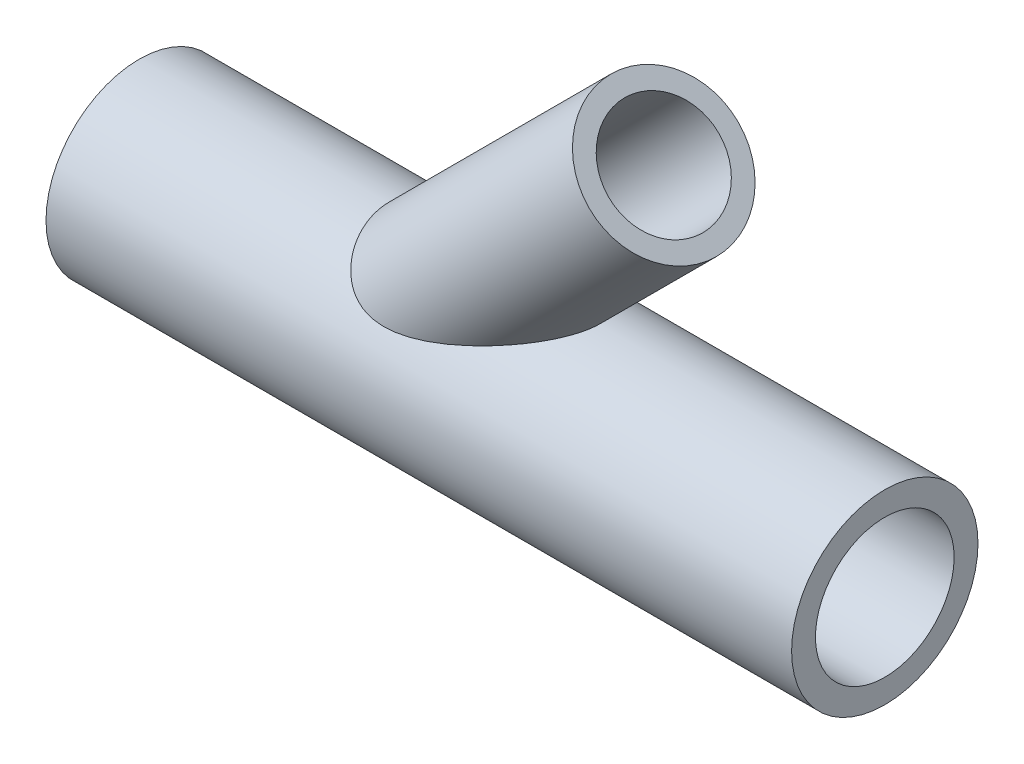
ISO-10303-21;
HEADER;
FILE_DESCRIPTION(('STEP AP214'),'2;1');
FILE_NAME('part.step','',(''),(''),'','','');
FILE_SCHEMA(('AUTOMOTIVE_DESIGN { 1 0 10303 214 1 1 1 1 }'));
ENDSEC;
DATA;
#1=APPLICATION_CONTEXT('core data for automotive mechanical design processes');
#2=APPLICATION_PROTOCOL_DEFINITION('international standard','automotive_design',2000,#1);
#3=PRODUCT_CONTEXT('',#1,'mechanical');
#4=PRODUCT('Part','Part','',(#3));
#5=PRODUCT_RELATED_PRODUCT_CATEGORY('part','',(#4));
#6=PRODUCT_DEFINITION_FORMATION('','',#4);
#7=PRODUCT_DEFINITION_CONTEXT('part definition',#1,'design');
#8=PRODUCT_DEFINITION('design','',#6,#7);
#9=PRODUCT_DEFINITION_SHAPE('','',#8);
#10=(LENGTH_UNIT() NAMED_UNIT(*) SI_UNIT(.MILLI.,.METRE.));
#11=(NAMED_UNIT(*) PLANE_ANGLE_UNIT() SI_UNIT($,.RADIAN.));
#12=(NAMED_UNIT(*) SI_UNIT($,.STERADIAN.) SOLID_ANGLE_UNIT());
#13=UNCERTAINTY_MEASURE_WITH_UNIT(LENGTH_MEASURE(1.E-05),#10,'distance_accuracy_value','');
#14=(GEOMETRIC_REPRESENTATION_CONTEXT(3) GLOBAL_UNCERTAINTY_ASSIGNED_CONTEXT((#13)) GLOBAL_UNIT_ASSIGNED_CONTEXT((#10,
#11,#12)) REPRESENTATION_CONTEXT('',''));
#15=CARTESIAN_POINT('',(0.,0.,0.));
#16=DIRECTION('',(0.,0.,1.));
#17=DIRECTION('',(1.,0.,0.));
#18=AXIS2_PLACEMENT_3D('',#15,#16,#17);
#19=CARTESIAN_POINT('',(70.3553390593273,35.3553390593274,0.));
#20=DIRECTION('',(-0.707106781186546,-0.707106781186549,0.));
#21=DIRECTION('',(0.707106781186549,-0.707106781186546,0.));
#22=AXIS2_PLACEMENT_3D('',#19,#20,#21);
#23=CYLINDRICAL_SURFACE('',#22,7.4);
#24=CARTESIAN_POINT('',(58.1651803615609,12.7,0.));
#25=CARTESIAN_POINT('',(58.1651789008527,12.699999548078,0.108244173223875));
#26=CARTESIAN_POINT('',(58.1604220787971,12.6986111948497,0.216495087531113));
#27=CARTESIAN_POINT('',(58.1415458061834,12.6931058585771,0.432122754992492));
#28=CARTESIAN_POINT('',(58.1274225068207,12.6889877538437,0.539499130419205));
#29=CARTESIAN_POINT('',(58.0714566474928,12.6726859282086,0.859342238657946));
#30=CARTESIAN_POINT('',(58.0160190450949,12.6565549918511,1.06933975447832));
#31=CARTESIAN_POINT('',(57.8567056953034,12.6103974116833,1.52753200641348));
#32=CARTESIAN_POINT('',(57.7442732832222,12.5779298023519,1.77242813326582));
#33=CARTESIAN_POINT('',(57.4831047096593,12.5030945500601,2.24032882942173));
#34=CARTESIAN_POINT('',(57.334300182515,12.4607082702662,2.46329105145652));
#35=CARTESIAN_POINT('',(57.0419304825086,12.378228131888,2.84604294677887));
#36=CARTESIAN_POINT('',(56.9029683798986,12.3392899427971,3.00968817793791));
#37=CARTESIAN_POINT('',(56.6116621701875,12.2583848845806,3.32390425584419));
#38=CARTESIAN_POINT('',(56.4593093972266,12.2164160573386,3.4744665086613));
#39=CARTESIAN_POINT('',(56.1439141003845,12.1304112645088,3.76376527884728));
#40=CARTESIAN_POINT('',(55.9808541138317,12.086371957093,3.90248158411888));
#41=CARTESIAN_POINT('',(55.6463062073331,11.9970525069504,4.16899077811774));
#42=CARTESIAN_POINT('',(55.4748151233686,11.9517719012539,4.29677951590353));
#43=CARTESIAN_POINT('',(55.1346061499625,11.8631046873902,4.53564402298606));
#44=CARTESIAN_POINT('',(54.9662512789594,11.8197502666544,4.64725190740537));
#45=CARTESIAN_POINT('',(54.6244056015769,11.7329236524064,4.86229862166291));
#46=CARTESIAN_POINT('',(54.4509138809425,11.6894514391956,4.96573598515197));
#47=CARTESIAN_POINT('',(54.0994643652391,11.6027391959096,5.16510087182581));
#48=CARTESIAN_POINT('',(53.9215037045194,11.5594993375755,5.26102340498121));
#49=CARTESIAN_POINT('',(53.5617985639735,11.4736085477517,5.44579410262459));
#50=CARTESIAN_POINT('',(53.380053641722,11.4309576861033,5.5346414340124));
#51=CARTESIAN_POINT('',(52.8288258714324,11.3041132779681,5.79169240960914));
#52=CARTESIAN_POINT('',(52.4543137969051,11.2212677939657,5.94986615567069));
#53=CARTESIAN_POINT('',(51.694872630965,11.0615745158114,6.24172679535999));
#54=CARTESIAN_POINT('',(51.309947090847,10.984724710834,6.37542191904198));
#55=CARTESIAN_POINT('',(50.4918836082852,10.8320228886013,6.63187334281567));
#56=CARTESIAN_POINT('',(50.0578039283282,10.7570562019773,6.75215959863586));
#57=CARTESIAN_POINT('',(49.1803862815186,10.6207938660031,6.9645282839267));
#58=CARTESIAN_POINT('',(48.737044404034,10.5595041242579,7.05659853219065));
#59=CARTESIAN_POINT('',(48.0674232859544,10.4812048927015,7.17192204174472));
#60=CARTESIAN_POINT('',(47.8438445671723,10.457407592918,7.20652536022737));
#61=CARTESIAN_POINT('',(47.3951314388341,10.4149145792035,7.2678025047416));
#62=CARTESIAN_POINT('',(47.1699972397554,10.3962181883952,7.29447738289838));
#63=CARTESIAN_POINT('',(46.7186270640839,10.3646003063861,7.33933331105119));
#64=CARTESIAN_POINT('',(46.4923919516263,10.351674852752,7.35752018945632));
#65=CARTESIAN_POINT('',(46.0391209733977,10.3322972869691,7.38470815376724));
#66=CARTESIAN_POINT('',(45.8120852677782,10.32584394651,7.39371098267381));
#67=CARTESIAN_POINT('',(45.34652199899,10.3200126872511,7.40184932305668));
#68=CARTESIAN_POINT('',(45.1079795798791,10.3209991898263,7.40047660842852));
#69=CARTESIAN_POINT('',(44.6314759862479,10.331774844477,7.38542629566381));
#70=CARTESIAN_POINT('',(44.3935147506239,10.3415630273626,7.37175005232039));
#71=CARTESIAN_POINT('',(43.9194209482662,10.3707139930897,7.33068446107193));
#72=CARTESIAN_POINT('',(43.6832876994213,10.3900730104502,7.30330050617823));
#73=CARTESIAN_POINT('',(43.2143057422556,10.4389465450687,7.2332721420223));
#74=CARTESIAN_POINT('',(42.9814570990882,10.468461263481,7.19062743048914));
#75=CARTESIAN_POINT('',(42.5178608388211,10.5383531834249,7.08780902864768));
#76=CARTESIAN_POINT('',(42.2871852196108,10.5788730800303,7.02740414129191));
#77=CARTESIAN_POINT('',(41.8336493493059,10.6702787499379,6.88782300464843));
#78=CARTESIAN_POINT('',(41.6107889237084,10.721164291616,6.80864717479771));
#79=CARTESIAN_POINT('',(41.1757936380917,10.8322209264459,6.63053381535525));
#80=CARTESIAN_POINT('',(40.9636467859811,10.8923813177128,6.53161902353354));
#81=CARTESIAN_POINT('',(40.5524824592066,11.0202564758945,6.31346972782465));
#82=CARTESIAN_POINT('',(40.3534626533053,11.0879698956848,6.19423884543008));
#83=CARTESIAN_POINT('',(39.9984241307966,11.2184032345781,5.95426604928342));
#84=CARTESIAN_POINT('',(39.8403361145002,11.2804421941622,5.83620400544654));
#85=CARTESIAN_POINT('',(39.5367075638536,11.4064798256842,5.58586101231295));
#86=CARTESIAN_POINT('',(39.3911659263064,11.4704783246486,5.45358131547029));
#87=CARTESIAN_POINT('',(39.1134852405948,11.5985649853126,5.17558801991359));
#88=CARTESIAN_POINT('',(38.9813505982292,11.6626531695153,5.0298700349533));
#89=CARTESIAN_POINT('',(38.7311401775431,11.7890186126778,4.72610713925576));
#90=CARTESIAN_POINT('',(38.6130641870496,11.8512958989569,4.56806241461316));
#91=CARTESIAN_POINT('',(38.3997374681528,11.9676823030759,4.25330091022975));
#92=CARTESIAN_POINT('',(38.3034350866742,12.0220527657829,4.09739117449186));
#93=CARTESIAN_POINT('',(38.1232754854543,12.1264752966166,3.77716229988067));
#94=CARTESIAN_POINT('',(38.0394183089028,12.1765273497565,3.61284313182594));
#95=CARTESIAN_POINT('',(37.8842082004383,12.2711928687847,3.27693016850308));
#96=CARTESIAN_POINT('',(37.8128535386878,12.3158070867869,3.105337383693));
#97=CARTESIAN_POINT('',(37.6826183038843,12.3986601891641,2.75598561254152));
#98=CARTESIAN_POINT('',(37.6237382951993,12.4368987850819,2.57822634764451));
#99=CARTESIAN_POINT('',(37.516204899705,12.5076726805187,2.21013591863197));
#100=CARTESIAN_POINT('',(37.4680838106593,12.539901626048,2.01959013424612));
#101=CARTESIAN_POINT('',(37.3852862429696,12.5958997285987,1.63437897617122));
#102=CARTESIAN_POINT('',(37.3506100492606,12.619668706329,1.43971351526692));
#103=CARTESIAN_POINT('',(37.2946474078205,12.6582560484483,1.04755810089604));
#104=CARTESIAN_POINT('',(37.2733631678357,12.6730729370141,0.850067687204109));
#105=CARTESIAN_POINT('',(37.2441586141583,12.6934479476326,0.45362637538676));
#106=CARTESIAN_POINT('',(37.2362384499825,12.6990059660974,0.254675460946324));
#107=CARTESIAN_POINT('',(37.2337170444398,12.700772452614,-0.148458214523873));
#108=CARTESIAN_POINT('',(37.2394624775178,12.6967375650261,-0.35264433855129));
#109=CARTESIAN_POINT('',(37.2650084805667,12.6788938399085,-0.759709382606115));
#110=CARTESIAN_POINT('',(37.2848093339524,12.6650848052917,-0.962588276191149));
#111=CARTESIAN_POINT('',(37.3385037992077,12.6279863459932,-1.36561956175567));
#112=CARTESIAN_POINT('',(37.3723989094782,12.6046959133222,-1.56577166150458));
#113=CARTESIAN_POINT('',(37.4543351148149,12.5491424832461,-1.96189242671704));
#114=CARTESIAN_POINT('',(37.5023761394314,12.5168795305262,-2.15786111300969));
#115=CARTESIAN_POINT('',(37.6127380860078,12.4440563017343,-2.54444496400459));
#116=CARTESIAN_POINT('',(37.6750776210915,12.4034852179752,-2.73505278389204));
#117=CARTESIAN_POINT('',(37.8140542677354,12.3150166599446,-3.10923202361647));
#118=CARTESIAN_POINT('',(37.890691463156,12.2671191427017,-3.29280340217487));
#119=CARTESIAN_POINT('',(38.058264779384,12.1651714743429,-3.65148743361262));
#120=CARTESIAN_POINT('',(38.1491987054172,12.1111222679596,-3.82660137945663));
#121=CARTESIAN_POINT('',(38.3453098606082,11.9982460940792,-4.16704342023861));
#122=CARTESIAN_POINT('',(38.4504866871698,11.9394192616473,-4.33237179159013));
#123=CARTESIAN_POINT('',(38.6722322957213,11.8199963666108,-4.64817301467837));
#124=CARTESIAN_POINT('',(38.7884724113481,11.7594751659759,-4.79890490748687));
#125=CARTESIAN_POINT('',(39.0339904315142,11.6369961474927,-5.08872019053185));
#126=CARTESIAN_POINT('',(39.1632680138832,11.575038365173,-5.22780386845328));
#127=CARTESIAN_POINT('',(39.4342031342707,11.4514216188833,-5.49330337844388));
#128=CARTESIAN_POINT('',(39.5758532908586,11.3897624995977,-5.61972666830649));
#129=CARTESIAN_POINT('',(39.8707599542376,11.2684058869802,-5.85927177983793));
#130=CARTESIAN_POINT('',(40.0240160949668,11.2087083318642,-5.97239402074515));
#131=CARTESIAN_POINT('',(40.334219497193,11.0953587335491,-6.18032659901079));
#132=CARTESIAN_POINT('',(40.4907256369596,11.0415571665897,-6.2757146925634));
#133=CARTESIAN_POINT('',(40.8121917653758,10.9384322094817,-6.4537812532788));
#134=CARTESIAN_POINT('',(40.9771512727383,10.8891085648278,-6.53646044294515));
#135=CARTESIAN_POINT('',(41.3142695358484,10.7959043857184,-6.68928011616111));
#136=CARTESIAN_POINT('',(41.4864291206593,10.7520244804103,-6.75941915082435));
#137=CARTESIAN_POINT('',(41.8366293064744,10.6703883328511,-6.8875669367877));
#138=CARTESIAN_POINT('',(42.0146712060171,10.6326334537372,-6.9455729886962));
#139=CARTESIAN_POINT('',(42.4345013025009,10.5523422986666,-7.0671801335223));
#140=CARTESIAN_POINT('',(42.6780487218826,10.5122977004548,-7.12637887311764));
#141=CARTESIAN_POINT('',(43.1705293269107,10.4439452972948,-7.22617767363826));
#142=CARTESIAN_POINT('',(43.4194642007605,10.415641229052,-7.26677181363382));
#143=CARTESIAN_POINT('',(43.9208983718915,10.3703171327896,-7.33130802499567));
#144=CARTESIAN_POINT('',(44.1734031511367,10.3533169663651,-7.35522078984305));
#145=CARTESIAN_POINT('',(44.6798950804663,10.3298705887473,-7.38810829599605));
#146=CARTESIAN_POINT('',(44.9338827285125,10.3234281550869,-7.39707769061667));
#147=CARTESIAN_POINT('',(45.5927279914035,10.3191305114363,-7.40308685161268));
#148=CARTESIAN_POINT('',(45.9977409690671,10.3286325714142,-7.38989886640816));
#149=CARTESIAN_POINT('',(46.8048820659145,10.3677010959368,-7.33497032035285));
#150=CARTESIAN_POINT('',(47.2070080576478,10.3972810741275,-7.29321052880724));
#151=CARTESIAN_POINT('',(48.0075096231026,10.4727301312731,-7.1844492367159));
#152=CARTESIAN_POINT('',(48.4058694304787,10.518650131083,-7.11736878853682));
#153=CARTESIAN_POINT('',(49.1961078229414,10.6233804191029,-6.96007928686144));
#154=CARTESIAN_POINT('',(49.5879880305333,10.6821874261542,-6.86987611964613));
#155=CARTESIAN_POINT('',(50.3946715176457,10.8148495181472,-6.65925886562449));
#156=CARTESIAN_POINT('',(50.8088657847118,10.8895225278042,-6.5370317398182));
#157=CARTESIAN_POINT('',(51.6271357204955,11.0475243226196,-6.26632624213842));
#158=CARTESIAN_POINT('',(52.0312075727184,11.1308563133168,-6.11783813411451));
#159=CARTESIAN_POINT('',(52.6269212365533,11.2600375636826,-5.87451273073009));
#160=CARTESIAN_POINT('',(52.8233698536201,11.3037018804226,-5.79016496731934));
#161=CARTESIAN_POINT('',(53.2127105715463,11.3921356336562,-5.6141745371604));
#162=CARTESIAN_POINT('',(53.4056030420154,11.4369049541567,-5.52253263385651));
#163=CARTESIAN_POINT('',(53.7872156460823,11.52716726742,-5.33156276867032));
#164=CARTESIAN_POINT('',(53.9759383946643,11.5726597739774,-5.23223981052693));
#165=CARTESIAN_POINT('',(54.3486648464014,11.6640107467336,-5.02530098212192));
#166=CARTESIAN_POINT('',(54.5326693991286,11.7098691450711,-4.91768661901036));
#167=CARTESIAN_POINT('',(54.8627696767981,11.7933466859682,-4.71347716549682));
#168=CARTESIAN_POINT('',(55.009767874715,11.8309749584089,-4.61834540420393));
#169=CARTESIAN_POINT('',(55.2994089389144,11.9059212597034,-4.42155271093671));
#170=CARTESIAN_POINT('',(55.4420521070534,11.9432393099284,-4.31989223300485));
#171=CARTESIAN_POINT('',(55.7224572952238,12.0173130436614,-4.10933851383398));
#172=CARTESIAN_POINT('',(55.8602108511002,12.0540676948586,-4.00043358706829));
#173=CARTESIAN_POINT('',(56.129594381824,12.1265697713528,-3.77496169096172));
#174=CARTESIAN_POINT('',(56.2612243485779,12.1623171953185,-3.6583947114943));
#175=CARTESIAN_POINT('',(56.5185568022069,12.2327432988591,-3.41557343080383));
#176=CARTESIAN_POINT('',(56.644175847798,12.2674054101849,-3.28922482258599));
#177=CARTESIAN_POINT('',(56.8861198106336,12.3346207780499,-3.0274441929099));
#178=CARTESIAN_POINT('',(57.0024426818437,12.3671735700434,-2.89201018380632));
#179=CARTESIAN_POINT('',(57.3337688920633,12.4604429358956,-2.47174080880281));
#180=CARTESIAN_POINT('',(57.5322118964101,12.5170688556738,-2.17195896347259));
#181=CARTESIAN_POINT('',(57.7965863831512,12.5930329022021,-1.6566860461604));
#182=CARTESIAN_POINT('',(57.8841110705632,12.618330491836,-1.45324667696206));
#183=CARTESIAN_POINT('',(57.9907266503023,12.6492314096893,-1.13930703813134));
#184=CARTESIAN_POINT('',(58.0221372300984,12.6583527641369,-1.03328967974186));
#185=CARTESIAN_POINT('',(58.0760614561397,12.6740291453028,-0.81885146370351));
#186=CARTESIAN_POINT('',(58.098579176272,12.6805853471244,-0.710431730697702));
#187=CARTESIAN_POINT('',(58.1324956621778,12.6904666011703,-0.501930606381205));
#188=CARTESIAN_POINT('',(58.144724085967,12.694032644962,-0.401995286887124));
#189=CARTESIAN_POINT('',(58.1610682441213,12.6987998836951,-0.201375389778799));
#190=CARTESIAN_POINT('',(58.165181720337,12.7000004203857,-0.100690611433872));
#191=CARTESIAN_POINT('',(58.1651803615609,12.7,0.));
#192=B_SPLINE_CURVE_WITH_KNOTS('',3,(#24,#25,#26,#27,#28,#29,#30,#31,#32,#33,#34,#35,#36,#37,
#38,#39,#40,#41,#42,#43,#44,#45,#46,#47,#48,#49,#50,#51,#52,#53,#54,#55,#56,#57,#58,#59,#60,#61,
#62,#63,#64,#65,#66,#67,#68,#69,#70,#71,#72,#73,#74,#75,#76,#77,#78,#79,#80,#81,#82,#83,#84,#85,
#86,#87,#88,#89,#90,#91,#92,#93,#94,#95,#96,#97,#98,#99,#100,#101,#102,#103,#104,#105,#106,#107,
#108,#109,#110,#111,#112,#113,#114,#115,#116,#117,#118,#119,#120,#121,#122,#123,#124,#125,#126,
#127,#128,#129,#130,#131,#132,#133,#134,#135,#136,#137,#138,#139,#140,#141,#142,#143,#144,#145,
#146,#147,#148,#149,#150,#151,#152,#153,#154,#155,#156,#157,#158,#159,#160,#161,#162,#163,#164,
#165,#166,#167,#168,#169,#170,#171,#172,#173,#174,#175,#176,#177,#178,#179,#180,#181,#182,#183,
#184,#185,#186,#187,#188,#189,#190,#191),.UNSPECIFIED.,.T.,.F.,(4,2,2,2,2,2,2,2,2,2,2,2,2,2,2,2,
2,2,2,2,2,2,2,2,2,2,2,2,2,2,2,2,2,2,2,2,2,2,2,2,2,2,2,2,2,2,2,2,2,2,2,2,2,2,2,2,2,2,2,2,2,2,2,2,
2,2,2,2,2,2,2,2,2,2,2,2,2,2,2,2,2,2,2,4),(0.,0.324623680192715,0.649380835096575,
1.29943679064074,2.10927581738179,2.92064889780288,3.57432073514649,4.22841875989913,
4.8836114210922,5.53905186807047,6.15857438663645,6.7782078384016,7.3982493144834,
8.01836369240016,9.2619739235965,10.5051652648016,11.873964764969,13.2433543634158,
13.9256585942986,14.6078722411216,15.2896167442325,15.9712318379377,16.6864433351718,
17.4015760871076,18.1164277059463,18.8312934846883,19.5559115968102,20.2805135188555,
21.00428552382,21.7279286458151,22.3475710252521,22.9671588641454,23.5869496566412,
24.2067310940729,24.7795431191258,25.3523571320189,25.9250918281563,26.4978524299542,
27.0946280187982,27.6914162542942,28.2883028482565,28.8851961201202,29.4973924513322,
30.1096011272874,30.7218749055574,31.3341456346218,31.9472179582421,32.5602938778397,
33.1732757723232,33.7862403436087,34.3846926186761,34.983130108945,35.5812129809202,
36.1792769967471,36.7516585592434,37.3240075696963,37.8964226665365,38.4689649812954,
39.2292483113778,39.9897734345466,40.7516313369487,41.5137617709177,42.7278154033749,
43.9426869782376,45.1613781329088,46.3797593566008,47.6935814750133,49.0078917125613,
49.6623818158574,50.3168035065166,50.9708024154885,51.6246827245904,52.1618111938561,
52.6989023486549,53.2368819028741,53.7748621681269,54.3189006243683,54.8630584924499,
55.9469476721284,56.6130334421023,56.9455188885536,57.2778518437013,57.5797384393799,
57.8817090293063),.UNSPECIFIED.);
#193=CARTESIAN_POINT('',(58.1651803615609,12.7,0.));
#194=VERTEX_POINT('',#193);
#195=EDGE_CURVE('E68',#194,#194,#192,.T.);
#196=ORIENTED_EDGE('',*,*,#195,.T.);
#197=EDGE_LOOP('',(#196));
#198=FACE_BOUND('',#197,.T.);
#199=CARTESIAN_POINT('',(70.3553390593273,35.3553390593274,0.));
#200=DIRECTION('',(0.707106781186546,0.707106781186549,0.));
#201=DIRECTION('',(-0.707106781186549,0.707106781186546,0.));
#202=AXIS2_PLACEMENT_3D('',#199,#200,#201);
#203=CIRCLE('',#202,7.4);
#204=CARTESIAN_POINT('',(65.1227488785468,40.5879292401079,0.));
#205=VERTEX_POINT('',#204);
#206=EDGE_CURVE('E58',#205,#205,#203,.T.);
#207=ORIENTED_EDGE('',*,*,#206,.T.);
#208=EDGE_LOOP('',(#207));
#209=FACE_BOUND('',#208,.T.);
#210=ADVANCED_FACE('F54',(#198,#209),#23,.F.);
#211=CARTESIAN_POINT('',(70.3553390593273,35.3553390593274,0.));
#212=DIRECTION('',(-0.707106781186546,-0.707106781186549,0.));
#213=DIRECTION('',(0.707106781186549,-0.707106781186546,0.));
#214=AXIS2_PLACEMENT_3D('',#211,#212,#213);
#215=CYLINDRICAL_SURFACE('',#214,10.);
#216=CARTESIAN_POINT('',(61.8421356237309,12.7,0.));
#217=CARTESIAN_POINT('',(61.8421371479667,12.7000005610799,0.131961662253304));
#218=CARTESIAN_POINT('',(61.8363710411209,12.6979381196656,0.263913481839501));
#219=CARTESIAN_POINT('',(61.8134807517401,12.6897530325315,0.526743182841068));
#220=CARTESIAN_POINT('',(61.7963527153073,12.6836290091477,0.657620684599788));
#221=CARTESIAN_POINT('',(61.7512136321504,12.6674974303103,0.917304174292113));
#222=CARTESIAN_POINT('',(61.7231964336132,12.6574876796256,1.04610894832894));
#223=CARTESIAN_POINT('',(61.6570076848368,12.6338556854685,1.30079343642201));
#224=CARTESIAN_POINT('',(61.6188306265074,12.620231482461,1.42667152342429));
#225=CARTESIAN_POINT('',(61.5225753549305,12.585909027954,1.70565062901165));
#226=CARTESIAN_POINT('',(61.461909321649,12.5642942325214,1.85774699790616));
#227=CARTESIAN_POINT('',(61.3279616564593,12.5166313422031,2.15562718860018));
#228=CARTESIAN_POINT('',(61.254670541312,12.4905799149417,2.30140616136184));
#229=CARTESIAN_POINT('',(61.0971923705312,12.4346889826039,2.586432874738));
#230=CARTESIAN_POINT('',(61.0129900393165,12.4048441679699,2.72567107880722));
#231=CARTESIAN_POINT('',(60.835427701731,12.3420176093802,2.99733793527496));
#232=CARTESIAN_POINT('',(60.7420697253734,12.3090365608474,3.12976808729163));
#233=CARTESIAN_POINT('',(60.484182719671,12.2181082846124,3.47226097622895));
#234=CARTESIAN_POINT('',(60.3129236885232,12.1578987299515,3.67666862119077));
#235=CARTESIAN_POINT('',(59.9542172714685,12.0322696932411,4.06902384139381));
#236=CARTESIAN_POINT('',(59.7667585082468,11.9668465521636,4.25695965854679));
#237=CARTESIAN_POINT('',(59.3790312542159,11.832118827383,4.61824439078994));
#238=CARTESIAN_POINT('',(59.178741393757,11.7628077937601,4.79156779625888));
#239=CARTESIAN_POINT('',(58.7682333801956,11.6214502826476,5.1249070931776));
#240=CARTESIAN_POINT('',(58.5580113502504,11.5494027391987,5.28491771980669));
#241=CARTESIAN_POINT('',(58.1233118819401,11.4012485027346,5.59752835826585));
#242=CARTESIAN_POINT('',(57.8985966871114,11.3250847823115,5.74976896531456));
#243=CARTESIAN_POINT('',(57.4423648902265,11.1714476500718,6.04285705798288));
#244=CARTESIAN_POINT('',(57.2108490756626,11.0939743903338,6.18370585570704));
#245=CARTESIAN_POINT('',(56.7419070646712,10.9381885391159,6.45527340144686));
#246=CARTESIAN_POINT('',(56.5044750820971,10.8598751723181,6.58598167328739));
#247=CARTESIAN_POINT('',(56.0247956336967,10.7029576445064,6.83803564325694));
#248=CARTESIAN_POINT('',(55.7825480621648,10.6243534771402,6.95938113558024));
#249=CARTESIAN_POINT('',(55.2931580738645,10.4670319143488,7.1938327195503));
#250=CARTESIAN_POINT('',(55.046002960765,10.388314907001,7.30691249814996));
#251=CARTESIAN_POINT('',(54.5480101390296,10.2313892567559,7.52507321517223));
#252=CARTESIAN_POINT('',(54.2971721276833,10.1531806564173,7.63015349164718));
#253=CARTESIAN_POINT('',(53.7923624255943,9.99769417282468,7.83277778483909));
#254=CARTESIAN_POINT('',(53.5383925144358,9.92041580624868,7.93032587155819));
#255=CARTESIAN_POINT('',(53.0274796373724,9.76712093818132,8.11837803056292));
#256=CARTESIAN_POINT('',(52.7705366061499,9.69110446450263,8.20888194775374));
#257=CARTESIAN_POINT('',(52.2123369019431,9.52862618041328,8.39721022123671));
#258=CARTESIAN_POINT('',(51.9106028698118,9.44245196770706,8.493868967614));
#259=CARTESIAN_POINT('',(51.3036919844342,9.27300154383056,8.67854495295752));
#260=CARTESIAN_POINT('',(50.9985150564926,9.18972539569583,8.76656200403469));
#261=CARTESIAN_POINT('',(50.3847095212583,9.02678359205008,8.93425154508552));
#262=CARTESIAN_POINT('',(50.0760789435634,8.94712014395162,9.01391897127239));
#263=CARTESIAN_POINT('',(49.4556620063932,8.79235051607829,9.16494734940578));
#264=CARTESIAN_POINT('',(49.1438757138277,8.71724423991395,9.23630847706951));
#265=CARTESIAN_POINT('',(48.5183474036244,8.57292051095795,9.37041619533412));
#266=CARTESIAN_POINT('',(48.2046166854046,8.50368255541787,9.43319329214827));
#267=CARTESIAN_POINT('',(47.5740923189728,8.3720768564062,9.55018744678488));
#268=CARTESIAN_POINT('',(47.2572984351277,8.30970964611257,9.60440384042787));
#269=CARTESIAN_POINT('',(46.6210286676381,8.19350619374254,9.7037257154964));
#270=CARTESIAN_POINT('',(46.3015555930413,8.13966196700759,9.74883973539137));
#271=CARTESIAN_POINT('',(45.6598263304905,8.04242989012919,9.82920672405434));
#272=CARTESIAN_POINT('',(45.3375708156593,7.99903958056086,9.86446201253597));
#273=CARTESIAN_POINT('',(44.7473712398146,7.93167225612642,9.91867447090217));
#274=CARTESIAN_POINT('',(44.4798297921823,7.90562402128103,9.9394066697135));
#275=CARTESIAN_POINT('',(43.9433692494618,7.86399088833764,9.97237993120289));
#276=CARTESIAN_POINT('',(43.6744501258429,7.84840620782109,9.98462081731091));
#277=CARTESIAN_POINT('',(43.1360125136861,7.82964155673413,9.99934321093796));
#278=CARTESIAN_POINT('',(42.8664944198919,7.82645499447297,10.0018299044611));
#279=CARTESIAN_POINT('',(42.3277744270969,7.83460975933379,9.99544617994009));
#280=CARTESIAN_POINT('',(42.0585724871158,7.84594893103973,9.98657744688269));
#281=CARTESIAN_POINT('',(41.5631795574895,7.88229609594536,9.95790368975085));
#282=CARTESIAN_POINT('',(41.3367113978302,7.90494655596093,9.93998013552232));
#283=CARTESIAN_POINT('',(40.8865735820033,7.96335779960396,9.89324746059373));
#284=CARTESIAN_POINT('',(40.6629036829345,7.99911743701684,9.86443929159454));
#285=CARTESIAN_POINT('',(40.2204786616722,8.0844433566493,9.79463169869313));
#286=CARTESIAN_POINT('',(40.0017162734446,8.13398753959401,9.75365178139837));
#287=CARTESIAN_POINT('',(39.570799881084,8.24703423638344,9.65825501872382));
#288=CARTESIAN_POINT('',(39.3586455764204,8.31053611438183,9.60383878542488));
#289=CARTESIAN_POINT('',(38.9415589106189,8.4513180868596,9.48019233907989));
#290=CARTESIAN_POINT('',(38.736689480516,8.52869401113909,9.41085837512174));
#291=CARTESIAN_POINT('',(38.337727136143,8.6953407849413,9.25709880867004));
#292=CARTESIAN_POINT('',(38.1436346202364,8.78461207375636,9.17267264878675));
#293=CARTESIAN_POINT('',(37.767478858459,8.97287231357693,8.98859790724729));
#294=CARTESIAN_POINT('',(37.5854290777521,9.07187184455169,8.88893268535838));
#295=CARTESIAN_POINT('',(37.2344362631513,9.27682349130739,8.67481917704987));
#296=CARTESIAN_POINT('',(37.0654933177454,9.38277565401861,8.5603707908388));
#297=CARTESIAN_POINT('',(36.7565737711554,9.58848840135513,8.32901586840473));
#298=CARTESIAN_POINT('',(36.6153729364219,9.68786873694251,8.21339693686312));
#299=CARTESIAN_POINT('',(36.3438449917091,9.88808454558737,7.97122703409634));
#300=CARTESIAN_POINT('',(36.2135168436319,9.98891987864443,7.8446771088897));
#301=CARTESIAN_POINT('',(35.9634639539604,10.1902727616607,7.58128102619809));
#302=CARTESIAN_POINT('',(35.8437395748214,10.290790300644,7.4444345170534));
#303=CARTESIAN_POINT('',(35.6145422379247,10.4899290262879,7.16110225015043));
#304=CARTESIAN_POINT('',(35.5050705915152,10.5885499690912,7.01461526342145));
#305=CARTESIAN_POINT('',(35.27744716401,10.7997232713608,6.68585101636826));
#306=CARTESIAN_POINT('',(35.1612068584262,10.9116390751966,6.50183793559778));
#307=CARTESIAN_POINT('',(34.9418698886712,11.1289345008368,6.12246863715461));
#308=CARTESIAN_POINT('',(34.8387743177445,11.2343135786094,5.92711147796171));
#309=CARTESIAN_POINT('',(34.6451843976133,11.4369211654628,5.52605905223785));
#310=CARTESIAN_POINT('',(34.5546959924708,11.5341458213337,5.32035897097935));
#311=CARTESIAN_POINT('',(34.3859680970813,11.7189816791754,4.89982015886693));
#312=CARTESIAN_POINT('',(34.3077290680428,11.8065925191338,4.68498108430259));
#313=CARTESIAN_POINT('',(34.1539728462681,11.9814819765097,4.21942188397106));
#314=CARTESIAN_POINT('',(34.0800701701506,12.0672984022484,3.96761574683367));
#315=CARTESIAN_POINT('',(33.9470863175516,12.2237937655783,3.45551306094629));
#316=CARTESIAN_POINT('',(33.8880063523763,12.2944714659698,3.19521582026946));
#317=CARTESIAN_POINT('',(33.7844338457452,12.4195813456174,2.66785450447587));
#318=CARTESIAN_POINT('',(33.7399435158767,12.4740110617915,2.40078941004977));
#319=CARTESIAN_POINT('',(33.6654142621561,12.5657717594221,1.86175399341119));
#320=CARTESIAN_POINT('',(33.6353751754038,12.6031029336201,1.58978372652764));
#321=CARTESIAN_POINT('',(33.5892344692677,12.6606306875451,1.03772257456195));
#322=CARTESIAN_POINT('',(33.5734017205359,12.6804965820444,0.757574636889979));
#323=CARTESIAN_POINT('',(33.5565919567633,12.7015925537757,0.196129248700871));
#324=CARTESIAN_POINT('',(33.5556152273634,12.7028222726846,-0.0851682238146874));
#325=CARTESIAN_POINT('',(33.5685149689417,12.6866268611763,-0.646865026477152));
#326=CARTESIAN_POINT('',(33.5823904353361,12.6692029924645,-0.927264416082672));
#327=CARTESIAN_POINT('',(33.6250312235671,12.6159738553046,-1.48516833470235));
#328=CARTESIAN_POINT('',(33.6537964284071,12.5801687312879,-1.76267288644533));
#329=CARTESIAN_POINT('',(33.7261044248567,12.4909847119356,-2.31130150596567));
#330=CARTESIAN_POINT('',(33.7695653997462,12.4377031624379,-2.58245219896369));
#331=CARTESIAN_POINT('',(33.8714478632404,12.3143547540901,-3.11804154253351));
#332=CARTESIAN_POINT('',(33.9298693882556,12.2442878543886,-3.38248017676806));
#333=CARTESIAN_POINT('',(34.0619301614943,12.0884671962578,-3.90291834790488));
#334=CARTESIAN_POINT('',(34.135575457273,12.0027072053974,-4.15891448406965));
#335=CARTESIAN_POINT('',(34.2984094949496,11.8169548751679,-4.66059221232636));
#336=CARTESIAN_POINT('',(34.3875981817455,11.7169625862531,-4.90627384097984));
#337=CARTESIAN_POINT('',(34.5826925532396,11.50374938724,-5.38734257282309));
#338=CARTESIAN_POINT('',(34.6887135567097,11.3904387355778,-5.62264319556367));
#339=CARTESIAN_POINT('',(34.9176605369605,11.1533538227076,-6.07938300030622));
#340=CARTESIAN_POINT('',(35.0405878486861,11.0295787355112,-6.30082108569238));
#341=CARTESIAN_POINT('',(35.3040719065091,10.77429601366,-6.7280332745568));
#342=CARTESIAN_POINT('',(35.4446195574969,10.6427923867239,-6.93381537177799));
#343=CARTESIAN_POINT('',(35.7442886980576,10.3752128233619,-7.32814301451009));
#344=CARTESIAN_POINT('',(35.903405403734,10.2391380709882,-7.51669297726767));
#345=CARTESIAN_POINT('',(36.2046598970536,9.9956982987533,-7.83627821176367));
#346=CARTESIAN_POINT('',(36.3430624348749,9.88846845488219,-7.9709493876516));
#347=CARTESIAN_POINT('',(36.6321259997222,9.67571959793721,-8.22789457869449));
#348=CARTESIAN_POINT('',(36.7827843036834,9.57020021103766,-8.35017133423387));
#349=CARTESIAN_POINT('',(37.0962068995901,9.36337409874885,-8.5814489036357));
#350=CARTESIAN_POINT('',(37.2589511925788,9.26206082827223,-8.69047089530467));
#351=CARTESIAN_POINT('',(37.5964823226496,9.06591501012337,-8.89490091411684));
#352=CARTESIAN_POINT('',(37.7712690949516,8.97108242759502,-8.99030901448476));
#353=CARTESIAN_POINT('',(38.1330600574015,8.78979926566444,-9.1676391651981));
#354=CARTESIAN_POINT('',(38.3201225327654,8.70339436993999,-9.2494892301242));
#355=CARTESIAN_POINT('',(38.7043498886713,8.54158779031724,-9.39911903823365));
#356=CARTESIAN_POINT('',(38.9015143118929,8.46618560891398,-9.46689941765844));
#357=CARTESIAN_POINT('',(39.304317690393,8.32780954210645,-9.58885370007632));
#358=CARTESIAN_POINT('',(39.5099601028395,8.26484078864914,-9.64302198712878));
#359=CARTESIAN_POINT('',(39.9277149336764,8.15206636483867,-9.73854553315919));
#360=CARTESIAN_POINT('',(40.1398282061362,8.10226244052921,-9.77989909265239));
#361=CARTESIAN_POINT('',(40.6196493825077,8.00551142709445,-9.85934275106099));
#362=CARTESIAN_POINT('',(40.8885780909656,7.9620628831189,-9.89431585355684));
#363=CARTESIAN_POINT('',(41.4303383941762,7.89403450229568,-9.94867222012643));
#364=CARTESIAN_POINT('',(41.7031712793552,7.86946105806088,-9.9680502025558));
#365=CARTESIAN_POINT('',(42.2509217586876,7.83708353187362,-9.99352430875617));
#366=CARTESIAN_POINT('',(42.5258424451438,7.82931332929731,-9.99959359934789));
#367=CARTESIAN_POINT('',(43.0757861464684,7.82832277565075,-10.0003671903977));
#368=CARTESIAN_POINT('',(43.3508091500244,7.83510913942869,-9.99506624584123));
#369=CARTESIAN_POINT('',(43.8934951383512,7.8607144496386,-9.97493932781823));
#370=CARTESIAN_POINT('',(44.1611808893556,7.87925068392529,-9.96033711186683));
#371=CARTESIAN_POINT('',(44.6950390258569,7.92623823065938,-9.92298555282671));
#372=CARTESIAN_POINT('',(44.9612116339797,7.95468804404434,-9.90023744148922));
#373=CARTESIAN_POINT('',(45.4920622890098,8.0199507962498,-9.84744378737453));
#374=CARTESIAN_POINT('',(45.756738506416,8.05677235027638,-9.81739072498826));
#375=CARTESIAN_POINT('',(46.2841723030944,8.13742503451982,-9.75064369508411));
#376=CARTESIAN_POINT('',(46.5469298207608,8.18125638878268,-9.71394951529909));
#377=CARTESIAN_POINT('',(47.0720066785291,8.27509028357966,-9.63414223374642));
#378=CARTESIAN_POINT('',(47.3343140144988,8.32512814068844,-9.59099207987782));
#379=CARTESIAN_POINT('',(47.8568590661051,8.43021713670124,-9.49875398019949));
#380=CARTESIAN_POINT('',(48.1170968230972,8.48526817515422,-9.44966615335874));
#381=CARTESIAN_POINT('',(48.635340917108,8.59955962513143,-9.34577635401356));
#382=CARTESIAN_POINT('',(48.8933484218014,8.65879767402195,-9.29097759590288));
#383=CARTESIAN_POINT('',(49.4072570984777,8.78082576920267,-9.17573662620187));
#384=CARTESIAN_POINT('',(49.6631582036404,8.84361592768089,-9.11529423632666));
#385=CARTESIAN_POINT('',(50.3027977658498,9.00496227400283,-8.95651734210105));
#386=CARTESIAN_POINT('',(50.6851673767832,9.10542613869244,-8.85457999861505));
#387=CARTESIAN_POINT('',(51.4447899660318,9.31150878448867,-8.63760420059726));
#388=CARTESIAN_POINT('',(51.8220425573906,9.41712795270007,-8.52256476137932));
#389=CARTESIAN_POINT('',(52.5715476095947,9.63231780721971,-8.27858449476874));
#390=CARTESIAN_POINT('',(52.9437919733236,9.74189403329175,-8.14962363263364));
#391=CARTESIAN_POINT('',(53.6820461482201,9.96364485851416,-7.87697104584898));
#392=CARTESIAN_POINT('',(54.0480563831174,10.075819279834,-7.73328032707515));
#393=CARTESIAN_POINT('',(54.7695218441261,10.3005950544531,-7.43120916893743));
#394=CARTESIAN_POINT('',(55.1250436537356,10.4131826827511,-7.27297813464918));
#395=CARTESIAN_POINT('',(55.8277498896063,10.6387219671223,-6.93889403756485));
#396=CARTESIAN_POINT('',(56.1749324278557,10.7516736991843,-6.76303703000452));
#397=CARTESIAN_POINT('',(56.8579896369514,10.9763860280143,-6.39186398267987));
#398=CARTESIAN_POINT('',(57.1938900240868,11.0881488714327,-6.1965968762349));
#399=CARTESIAN_POINT('',(57.8521369771199,11.3092010975283,-5.78333276760671));
#400=CARTESIAN_POINT('',(58.1744923784835,11.4184920704386,-5.56535091580054));
#401=CARTESIAN_POINT('',(58.644373223449,11.5790261445327,-5.2184585280227));
#402=CARTESIAN_POINT('',(58.7987106390397,11.6319655210856,-5.09952016676244));
#403=CARTESIAN_POINT('',(59.1020590930448,11.7363848612058,-4.85438361303395));
#404=CARTESIAN_POINT('',(59.2510699958581,11.7878647876119,-4.72818523595504));
#405=CARTESIAN_POINT('',(59.5430268229087,11.8890516934565,-4.46766306715771));
#406=CARTESIAN_POINT('',(59.6859603900536,11.9387550306551,-4.33332395236991));
#407=CARTESIAN_POINT('',(59.9641616239232,12.0357739359285,-4.05607178503929));
#408=CARTESIAN_POINT('',(60.0994292332759,12.0830894861329,-3.91315866834531));
#409=CARTESIAN_POINT('',(60.3623594135742,12.1752946879326,-3.61617074125035));
#410=CARTESIAN_POINT('',(60.4898998297241,12.2201446654665,-3.46197469424105));
#411=CARTESIAN_POINT('',(60.7332885343536,12.305924738208,-3.14347151395772));
#412=CARTESIAN_POINT('',(60.8491350345009,12.3468542338136,-2.97916284034154));
#413=CARTESIAN_POINT('',(61.0661421339063,12.4236691539058,-2.64054990276835));
#414=CARTESIAN_POINT('',(61.1673402183463,12.4595674454395,-2.46627280353719));
#415=CARTESIAN_POINT('',(61.352175205998,12.5252331443529,-2.10753737685843));
#416=CARTESIAN_POINT('',(61.4358230444201,12.5550043691643,-1.92308548016059));
#417=CARTESIAN_POINT('',(61.5621226830204,12.6000053109525,-1.59660034094221));
#418=CARTESIAN_POINT('',(61.6097331876123,12.6169863975836,-1.45672161916488));
#419=CARTESIAN_POINT('',(61.6925091189302,12.6465276392839,-1.17289023957444));
#420=CARTESIAN_POINT('',(61.7276793818135,12.6590895123167,-1.0289391884396));
#421=CARTESIAN_POINT('',(61.7844071617152,12.6793585808099,-0.738275655136888));
#422=CARTESIAN_POINT('',(61.8059874414898,12.6870738940377,-0.591568216683002));
#423=CARTESIAN_POINT('',(61.8348500623308,12.6973940189692,-0.296569597308956));
#424=CARTESIAN_POINT('',(61.8421339110249,12.6999993695432,-0.148278585042742));
#425=CARTESIAN_POINT('',(61.8421356237309,12.7,0.));
#426=B_SPLINE_CURVE_WITH_KNOTS('',3,(#216,#217,#218,#219,#220,#221,#222,#223,#224,#225,#226,
#227,#228,#229,#230,#231,#232,#233,#234,#235,#236,#237,#238,#239,#240,#241,#242,#243,#244,#245,
#246,#247,#248,#249,#250,#251,#252,#253,#254,#255,#256,#257,#258,#259,#260,#261,#262,#263,#264,
#265,#266,#267,#268,#269,#270,#271,#272,#273,#274,#275,#276,#277,#278,#279,#280,#281,#282,#283,
#284,#285,#286,#287,#288,#289,#290,#291,#292,#293,#294,#295,#296,#297,#298,#299,#300,#301,#302,
#303,#304,#305,#306,#307,#308,#309,#310,#311,#312,#313,#314,#315,#316,#317,#318,#319,#320,#321,
#322,#323,#324,#325,#326,#327,#328,#329,#330,#331,#332,#333,#334,#335,#336,#337,#338,#339,#340,
#341,#342,#343,#344,#345,#346,#347,#348,#349,#350,#351,#352,#353,#354,#355,#356,#357,#358,#359,
#360,#361,#362,#363,#364,#365,#366,#367,#368,#369,#370,#371,#372,#373,#374,#375,#376,#377,#378,
#379,#380,#381,#382,#383,#384,#385,#386,#387,#388,#389,#390,#391,#392,#393,#394,#395,#396,#397,
#398,#399,#400,#401,#402,#403,#404,#405,#406,#407,#408,#409,#410,#411,#412,#413,#414,#415,#416,
#417,#418,#419,#420,#421,#422,#423,#424,#425),.UNSPECIFIED.,.T.,.F.,(4,2,2,2,2,2,2,2,2,2,2,2,2,
2,2,2,2,2,2,2,2,2,2,2,2,2,2,2,2,2,2,2,2,2,2,2,2,2,2,2,2,2,2,2,2,2,2,2,2,2,2,2,2,2,2,2,2,2,2,2,2,
2,2,2,2,2,2,2,2,2,2,2,2,2,2,2,2,2,2,2,2,2,2,2,2,2,2,2,2,2,2,2,2,2,2,2,2,2,2,2,2,2,2,2,4),(0.,
0.395728239181967,0.791590775669124,1.18767727985176,1.58397895830978,2.07872001736298,
2.57383433110403,3.06964944333094,3.56535486963306,4.38412955351799,5.20348402259674,
6.02424047419237,6.84531998356965,7.69069642681309,8.53597536082282,9.38211623473057,
10.2282757025883,11.0770210504172,11.9258365545729,12.7741901459698,13.6225624106896,
14.6074544966845,15.5923679916124,16.5778753908541,17.5633619381983,18.5452497718118,
19.5272137474912,20.5082522662211,21.4890597565483,22.2975901461181,23.1061373479261,
23.9142546117461,24.7222519761391,25.4065896872678,26.0908675768819,26.7740546968826,
27.4572107005691,28.1452811035903,28.8333769238972,29.5222295454742,30.2110868172871,
30.8339022073736,31.4566580643343,32.0794351999679,32.702291881765,33.4357707773018,
34.1693106363631,34.9031951848603,35.6371073586274,36.4644511128125,37.2918624552048,
38.1193991638174,38.9469265438831,39.7898042328819,40.6326981281115,41.4755350146557,
42.3183652786751,43.1565784124241,43.9947935862012,44.833342378207,45.6718881975817,
46.5164487255525,47.3610759794859,48.2052690425213,49.0492450964627,49.7112660358741,
50.373140282883,51.033942720951,51.6947416046414,52.3589436848063,53.0231157227221,
53.6875613298558,54.3520950178615,55.1747257934083,55.9976350545922,56.822201957773,
57.6471493100336,58.4529643286593,59.2586575503845,60.0651836795734,60.8717355919618,
61.6831078722001,62.4944638982352,63.3053656945325,64.1162931162556,65.3408301634768,
66.5654593014104,67.7918749475156,69.0182068995957,70.2331083392941,71.4482822885803,
72.6604669168948,73.8718481503362,74.4774225471988,75.0830123496701,75.6897797506092,
76.2965516919829,76.9112350659979,77.5260123006194,78.1391874054613,78.7519793109382,
79.1976073848602,79.6430620294969,80.0877685543461,80.5324281802208),.UNSPECIFIED.);
#427=CARTESIAN_POINT('',(61.8421356237309,12.7,0.));
#428=VERTEX_POINT('',#427);
#429=EDGE_CURVE('E62',#428,#428,#426,.T.);
#430=ORIENTED_EDGE('',*,*,#429,.F.);
#431=EDGE_LOOP('',(#430));
#432=FACE_BOUND('',#431,.T.);
#433=CARTESIAN_POINT('',(70.3553390593273,35.3553390593274,0.));
#434=DIRECTION('',(0.707106781186546,0.707106781186549,0.));
#435=DIRECTION('',(-0.707106781186549,0.707106781186546,0.));
#436=AXIS2_PLACEMENT_3D('',#433,#434,#435);
#437=CIRCLE('',#436,10.);
#438=CARTESIAN_POINT('',(63.2842712474618,42.4264068711929,0.));
#439=VERTEX_POINT('',#438);
#440=EDGE_CURVE('E12',#439,#439,#437,.T.);
#441=ORIENTED_EDGE('',*,*,#440,.F.);
#442=EDGE_LOOP('',(#441));
#443=FACE_BOUND('',#442,.T.);
#444=ADVANCED_FACE('F80',(#432,#443),#215,.T.);
#445=CARTESIAN_POINT('',(100.,0.,0.));
#446=DIRECTION('',(-1.,0.,0.));
#447=DIRECTION('',(0.,0.,1.));
#448=AXIS2_PLACEMENT_3D('',#445,#446,#447);
#449=CYLINDRICAL_SURFACE('',#448,12.7);
#450=ORIENTED_EDGE('',*,*,#195,.F.);
#451=EDGE_LOOP('',(#450));
#452=FACE_BOUND('',#451,.T.);
#453=ORIENTED_EDGE('',*,*,#429,.T.);
#454=EDGE_LOOP('',(#453));
#455=FACE_BOUND('',#454,.T.);
#456=ADVANCED_FACE('F77',(#452,#455),#449,.F.);
#457=CARTESIAN_POINT('',(70.3553390593273,35.3553390593274,0.));
#458=DIRECTION('',(0.707106781186546,0.707106781186549,0.));
#459=DIRECTION('',(-0.707106781186549,0.707106781186546,0.));
#460=AXIS2_PLACEMENT_3D('',#457,#458,#459);
#461=PLANE('',#460);
#462=ORIENTED_EDGE('',*,*,#206,.F.);
#463=EDGE_LOOP('',(#462));
#464=FACE_BOUND('',#463,.T.);
#465=ORIENTED_EDGE('',*,*,#440,.T.);
#466=EDGE_LOOP('',(#465));
#467=FACE_BOUND('',#466,.T.);
#468=ADVANCED_FACE('F56',(#464,#467),#461,.T.);
#469=CLOSED_SHELL('',(#210,#444,#456,#468));
#470=MANIFOLD_SOLID_BREP('B2',#469);
#471=CARTESIAN_POINT('',(100.,0.,0.));
#472=DIRECTION('',(-1.,0.,0.));
#473=DIRECTION('',(0.,0.,1.));
#474=AXIS2_PLACEMENT_3D('',#471,#472,#473);
#475=CYLINDRICAL_SURFACE('',#474,9.3);
#476=CARTESIAN_POINT('',(100.,0.,0.));
#477=DIRECTION('',(1.,0.,0.));
#478=DIRECTION('',(0.,0.,-1.));
#479=AXIS2_PLACEMENT_3D('',#476,#477,#478);
#480=CIRCLE('',#479,9.3);
#481=CARTESIAN_POINT('',(100.,0.,-9.3));
#482=VERTEX_POINT('',#481);
#483=EDGE_CURVE('E139',#482,#482,#480,.T.);
#484=ORIENTED_EDGE('',*,*,#483,.T.);
#485=EDGE_LOOP('',(#484));
#486=FACE_BOUND('',#485,.T.);
#487=CARTESIAN_POINT('',(0.,0.,0.));
#488=DIRECTION('',(1.,0.,0.));
#489=DIRECTION('',(0.,0.,-1.));
#490=AXIS2_PLACEMENT_3D('',#487,#488,#489);
#491=CIRCLE('',#490,9.3);
#492=CARTESIAN_POINT('',(0.,0.,-9.3));
#493=VERTEX_POINT('',#492);
#494=EDGE_CURVE('E145',#493,#493,#491,.T.);
#495=ORIENTED_EDGE('',*,*,#494,.F.);
#496=EDGE_LOOP('',(#495));
#497=FACE_BOUND('',#496,.T.);
#498=ADVANCED_FACE('F132',(#486,#497),#475,.F.);
#499=CARTESIAN_POINT('',(100.,0.,0.));
#500=DIRECTION('',(-1.,0.,0.));
#501=DIRECTION('',(0.,0.,1.));
#502=AXIS2_PLACEMENT_3D('',#499,#500,#501);
#503=CYLINDRICAL_SURFACE('',#502,12.5);
#504=CARTESIAN_POINT('',(100.,0.,0.));
#505=DIRECTION('',(1.,0.,0.));
#506=DIRECTION('',(0.,0.,-1.));
#507=AXIS2_PLACEMENT_3D('',#504,#505,#506);
#508=CIRCLE('',#507,12.5);
#509=CARTESIAN_POINT('',(100.,0.,-12.5));
#510=VERTEX_POINT('',#509);
#511=EDGE_CURVE('E53',#510,#510,#508,.T.);
#512=ORIENTED_EDGE('',*,*,#511,.F.);
#513=EDGE_LOOP('',(#512));
#514=FACE_BOUND('',#513,.T.);
#515=CARTESIAN_POINT('',(0.,0.,0.));
#516=DIRECTION('',(1.,0.,0.));
#517=DIRECTION('',(0.,0.,-1.));
#518=AXIS2_PLACEMENT_3D('',#515,#516,#517);
#519=CIRCLE('',#518,12.5);
#520=CARTESIAN_POINT('',(0.,0.,-12.5));
#521=VERTEX_POINT('',#520);
#522=EDGE_CURVE('E135',#521,#521,#519,.T.);
#523=ORIENTED_EDGE('',*,*,#522,.T.);
#524=EDGE_LOOP('',(#523));
#525=FACE_BOUND('',#524,.T.);
#526=ADVANCED_FACE('F152',(#514,#525),#503,.T.);
#527=CARTESIAN_POINT('',(100.,0.,0.));
#528=DIRECTION('',(1.,0.,0.));
#529=DIRECTION('',(0.,0.,-1.));
#530=AXIS2_PLACEMENT_3D('',#527,#528,#529);
#531=PLANE('',#530);
#532=ORIENTED_EDGE('',*,*,#483,.F.);
#533=EDGE_LOOP('',(#532));
#534=FACE_BOUND('',#533,.T.);
#535=ORIENTED_EDGE('',*,*,#511,.T.);
#536=EDGE_LOOP('',(#535));
#537=FACE_BOUND('',#536,.T.);
#538=ADVANCED_FACE('F156',(#534,#537),#531,.T.);
#539=CARTESIAN_POINT('',(0.,0.,0.));
#540=DIRECTION('',(1.,0.,0.));
#541=DIRECTION('',(0.,0.,-1.));
#542=AXIS2_PLACEMENT_3D('',#539,#540,#541);
#543=PLANE('',#542);
#544=ORIENTED_EDGE('',*,*,#494,.T.);
#545=EDGE_LOOP('',(#544));
#546=FACE_BOUND('',#545,.T.);
#547=ORIENTED_EDGE('',*,*,#522,.F.);
#548=EDGE_LOOP('',(#547));
#549=FACE_BOUND('',#548,.T.);
#550=ADVANCED_FACE('F154',(#546,#549),#543,.F.);
#551=CLOSED_SHELL('',(#498,#526,#538,#550));
#552=MANIFOLD_SOLID_BREP('B7',#551);
#553=ADVANCED_BREP_SHAPE_REPRESENTATION('',(#18,#470,#552),#14);
#554=SHAPE_DEFINITION_REPRESENTATION(#9,#553);
ENDSEC;
END-ISO-10303-21;
